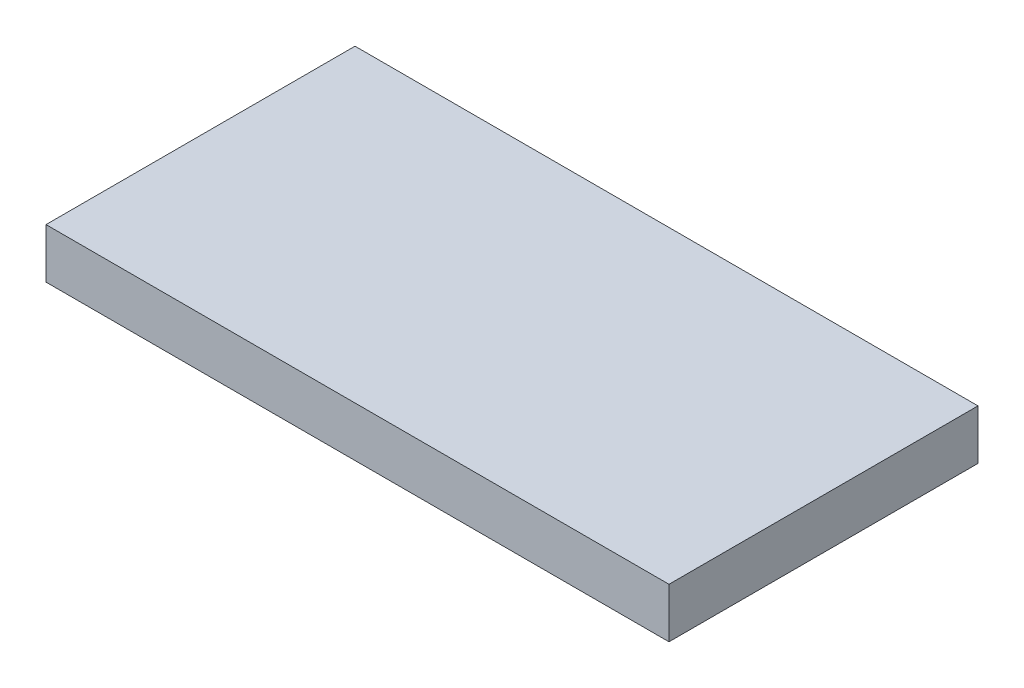
ISO-10303-21;
HEADER;
FILE_DESCRIPTION(('STEP AP214'),'2;1');
FILE_NAME('part.step','',(''),(''),'','','');
FILE_SCHEMA(('AUTOMOTIVE_DESIGN { 1 0 10303 214 1 1 1 1 }'));
ENDSEC;
DATA;
#1=APPLICATION_CONTEXT('core data for automotive mechanical design processes');
#2=APPLICATION_PROTOCOL_DEFINITION('international standard','automotive_design',2000,#1);
#3=PRODUCT_CONTEXT('',#1,'mechanical');
#4=PRODUCT('Part','Part','',(#3));
#5=PRODUCT_RELATED_PRODUCT_CATEGORY('part','',(#4));
#6=PRODUCT_DEFINITION_FORMATION('','',#4);
#7=PRODUCT_DEFINITION_CONTEXT('part definition',#1,'design');
#8=PRODUCT_DEFINITION('design','',#6,#7);
#9=PRODUCT_DEFINITION_SHAPE('','',#8);
#10=(LENGTH_UNIT() NAMED_UNIT(*) SI_UNIT(.MILLI.,.METRE.));
#11=(NAMED_UNIT(*) PLANE_ANGLE_UNIT() SI_UNIT($,.RADIAN.));
#12=(NAMED_UNIT(*) SI_UNIT($,.STERADIAN.) SOLID_ANGLE_UNIT());
#13=UNCERTAINTY_MEASURE_WITH_UNIT(LENGTH_MEASURE(1.E-05),#10,'distance_accuracy_value','');
#14=(GEOMETRIC_REPRESENTATION_CONTEXT(3) GLOBAL_UNCERTAINTY_ASSIGNED_CONTEXT((#13)) GLOBAL_UNIT_ASSIGNED_CONTEXT((#10,
#11,#12)) REPRESENTATION_CONTEXT('',''));
#15=CARTESIAN_POINT('',(0.,0.,0.));
#16=DIRECTION('',(0.,0.,1.));
#17=DIRECTION('',(1.,0.,0.));
#18=AXIS2_PLACEMENT_3D('',#15,#16,#17);
#19=CARTESIAN_POINT('',(-5.36918040793806,38.4864983767566,241.582525583809));
#20=DIRECTION('',(0.,1.,0.));
#21=DIRECTION('',(0.,0.,1.));
#22=AXIS2_PLACEMENT_3D('',#19,#20,#21);
#23=PLANE('',#22);
#24=DIRECTION('',(0.,0.,-1.));
#25=VECTOR('',#24,1.);
#26=CARTESIAN_POINT('',(-6.95668040793807,38.4864983767566,240.795125583809));
#27=LINE('',#26,#25);
#28=CARTESIAN_POINT('',(-6.95668040793807,38.4864983767566,242.36992558381));
#29=VERTEX_POINT('',#28);
#30=CARTESIAN_POINT('',(-6.95668040793807,38.4864983767566,240.795125583809));
#31=VERTEX_POINT('',#30);
#32=EDGE_CURVE('E20',#29,#31,#27,.T.);
#33=ORIENTED_EDGE('',*,*,#32,.T.);
#34=DIRECTION('',(1.,0.,0.));
#35=VECTOR('',#34,1.);
#36=CARTESIAN_POINT('',(-6.95668040793807,38.4864983767566,240.795125583809));
#37=LINE('',#36,#35);
#38=CARTESIAN_POINT('',(-3.78168040793806,38.4864983767566,240.795125583809));
#39=VERTEX_POINT('',#38);
#40=EDGE_CURVE('E87',#31,#39,#37,.T.);
#41=ORIENTED_EDGE('',*,*,#40,.T.);
#42=DIRECTION('',(0.,0.,1.));
#43=VECTOR('',#42,1.);
#44=CARTESIAN_POINT('',(-3.78168040793806,38.4864983767566,240.795125583809));
#45=LINE('',#44,#43);
#46=CARTESIAN_POINT('',(-3.78168040793806,38.4864983767566,242.36992558381));
#47=VERTEX_POINT('',#46);
#48=EDGE_CURVE('E56',#39,#47,#45,.T.);
#49=ORIENTED_EDGE('',*,*,#48,.T.);
#50=DIRECTION('',(-1.,0.,0.));
#51=VECTOR('',#50,1.);
#52=CARTESIAN_POINT('',(-6.95668040793807,38.4864983767566,242.36992558381));
#53=LINE('',#52,#51);
#54=EDGE_CURVE('E58',#47,#29,#53,.T.);
#55=ORIENTED_EDGE('',*,*,#54,.T.);
#56=EDGE_LOOP('',(#33,#41,#49,#55));
#57=FACE_BOUND('',#56,.T.);
#58=ADVANCED_FACE('F17',(#57),#23,.F.);
#59=CARTESIAN_POINT('',(-6.95668040793807,38.7404983767566,240.795125583809));
#60=DIRECTION('',(1.,0.,0.));
#61=DIRECTION('',(0.,0.,-1.));
#62=AXIS2_PLACEMENT_3D('',#59,#60,#61);
#63=PLANE('',#62);
#64=DIRECTION('',(0.,0.,1.));
#65=VECTOR('',#64,1.);
#66=CARTESIAN_POINT('',(-6.95668040793807,38.7404983767566,241.582525583809));
#67=LINE('',#66,#65);
#68=CARTESIAN_POINT('',(-6.95668040793807,38.7404983767566,240.795125583809));
#69=VERTEX_POINT('',#68);
#70=CARTESIAN_POINT('',(-6.95668040793807,38.7404983767566,242.36992558381));
#71=VERTEX_POINT('',#70);
#72=EDGE_CURVE('E94',#69,#71,#67,.T.);
#73=ORIENTED_EDGE('',*,*,#72,.F.);
#74=DIRECTION('',(0.,1.,0.));
#75=VECTOR('',#74,1.);
#76=CARTESIAN_POINT('',(-6.95668040793807,38.7404983767566,240.795125583809));
#77=LINE('',#76,#75);
#78=EDGE_CURVE('E70',#69,#31,#77,.F.);
#79=ORIENTED_EDGE('',*,*,#78,.T.);
#80=ORIENTED_EDGE('',*,*,#32,.F.);
#81=DIRECTION('',(0.,1.,0.));
#82=VECTOR('',#81,1.);
#83=CARTESIAN_POINT('',(-6.95668040793807,38.7404983767566,242.36992558381));
#84=LINE('',#83,#82);
#85=EDGE_CURVE('E65',#29,#71,#84,.T.);
#86=ORIENTED_EDGE('',*,*,#85,.T.);
#87=EDGE_LOOP('',(#73,#79,#80,#86));
#88=FACE_BOUND('',#87,.T.);
#89=ADVANCED_FACE('F67',(#88),#63,.F.);
#90=CARTESIAN_POINT('',(-6.95668040793807,38.7404983767566,242.36992558381));
#91=DIRECTION('',(0.,0.,-1.));
#92=DIRECTION('',(-1.,0.,0.));
#93=AXIS2_PLACEMENT_3D('',#90,#91,#92);
#94=PLANE('',#93);
#95=DIRECTION('',(1.,0.,0.));
#96=VECTOR('',#95,1.);
#97=CARTESIAN_POINT('',(-5.36918040793806,38.7404983767566,242.36992558381));
#98=LINE('',#97,#96);
#99=CARTESIAN_POINT('',(-3.78168040793806,38.7404983767566,242.36992558381));
#100=VERTEX_POINT('',#99);
#101=EDGE_CURVE('E75',#71,#100,#98,.T.);
#102=ORIENTED_EDGE('',*,*,#101,.F.);
#103=ORIENTED_EDGE('',*,*,#85,.F.);
#104=ORIENTED_EDGE('',*,*,#54,.F.);
#105=DIRECTION('',(0.,1.,0.));
#106=VECTOR('',#105,1.);
#107=CARTESIAN_POINT('',(-3.78168040793806,38.7404983767566,242.36992558381));
#108=LINE('',#107,#106);
#109=EDGE_CURVE('E83',#47,#100,#108,.T.);
#110=ORIENTED_EDGE('',*,*,#109,.T.);
#111=EDGE_LOOP('',(#102,#103,#104,#110));
#112=FACE_BOUND('',#111,.T.);
#113=ADVANCED_FACE('F73',(#112),#94,.F.);
#114=CARTESIAN_POINT('',(-3.78168040793806,38.7404983767566,240.795125583809));
#115=DIRECTION('',(-1.,0.,0.));
#116=DIRECTION('',(0.,0.,1.));
#117=AXIS2_PLACEMENT_3D('',#114,#115,#116);
#118=PLANE('',#117);
#119=DIRECTION('',(0.,0.,1.));
#120=VECTOR('',#119,1.);
#121=CARTESIAN_POINT('',(-3.78168040793806,38.7404983767566,241.582525583809));
#122=LINE('',#121,#120);
#123=CARTESIAN_POINT('',(-3.78168040793806,38.7404983767566,240.795125583809));
#124=VERTEX_POINT('',#123);
#125=EDGE_CURVE('E27',#100,#124,#122,.F.);
#126=ORIENTED_EDGE('',*,*,#125,.F.);
#127=ORIENTED_EDGE('',*,*,#109,.F.);
#128=ORIENTED_EDGE('',*,*,#48,.F.);
#129=DIRECTION('',(0.,1.,0.));
#130=VECTOR('',#129,1.);
#131=CARTESIAN_POINT('',(-3.78168040793806,38.7404983767566,240.795125583809));
#132=LINE('',#131,#130);
#133=EDGE_CURVE('E36',#39,#124,#132,.T.);
#134=ORIENTED_EDGE('',*,*,#133,.T.);
#135=EDGE_LOOP('',(#126,#127,#128,#134));
#136=FACE_BOUND('',#135,.T.);
#137=ADVANCED_FACE('F102',(#136),#118,.F.);
#138=CARTESIAN_POINT('',(-6.95668040793807,38.7404983767566,240.795125583809));
#139=DIRECTION('',(0.,0.,1.));
#140=DIRECTION('',(1.,0.,0.));
#141=AXIS2_PLACEMENT_3D('',#138,#139,#140);
#142=PLANE('',#141);
#143=DIRECTION('',(1.,0.,0.));
#144=VECTOR('',#143,1.);
#145=CARTESIAN_POINT('',(-5.36918040793806,38.7404983767566,240.795125583809));
#146=LINE('',#145,#144);
#147=EDGE_CURVE('E11',#124,#69,#146,.F.);
#148=ORIENTED_EDGE('',*,*,#147,.F.);
#149=ORIENTED_EDGE('',*,*,#133,.F.);
#150=ORIENTED_EDGE('',*,*,#40,.F.);
#151=ORIENTED_EDGE('',*,*,#78,.F.);
#152=EDGE_LOOP('',(#148,#149,#150,#151));
#153=FACE_BOUND('',#152,.T.);
#154=ADVANCED_FACE('F104',(#153),#142,.F.);
#155=CARTESIAN_POINT('',(-5.36918040793806,38.7404983767566,241.582525583809));
#156=DIRECTION('',(0.,1.,0.));
#157=DIRECTION('',(0.,0.,1.));
#158=AXIS2_PLACEMENT_3D('',#155,#156,#157);
#159=PLANE('',#158);
#160=ORIENTED_EDGE('',*,*,#125,.T.);
#161=ORIENTED_EDGE('',*,*,#147,.T.);
#162=ORIENTED_EDGE('',*,*,#72,.T.);
#163=ORIENTED_EDGE('',*,*,#101,.T.);
#164=EDGE_LOOP('',(#160,#161,#162,#163));
#165=FACE_BOUND('',#164,.T.);
#166=ADVANCED_FACE('F101',(#165),#159,.T.);
#167=CLOSED_SHELL('',(#58,#89,#113,#137,#154,#166));
#168=MANIFOLD_SOLID_BREP('B1',#167);
#169=ADVANCED_BREP_SHAPE_REPRESENTATION('',(#18,#168),#14);
#170=SHAPE_DEFINITION_REPRESENTATION(#9,#169);
ENDSEC;
END-ISO-10303-21;
